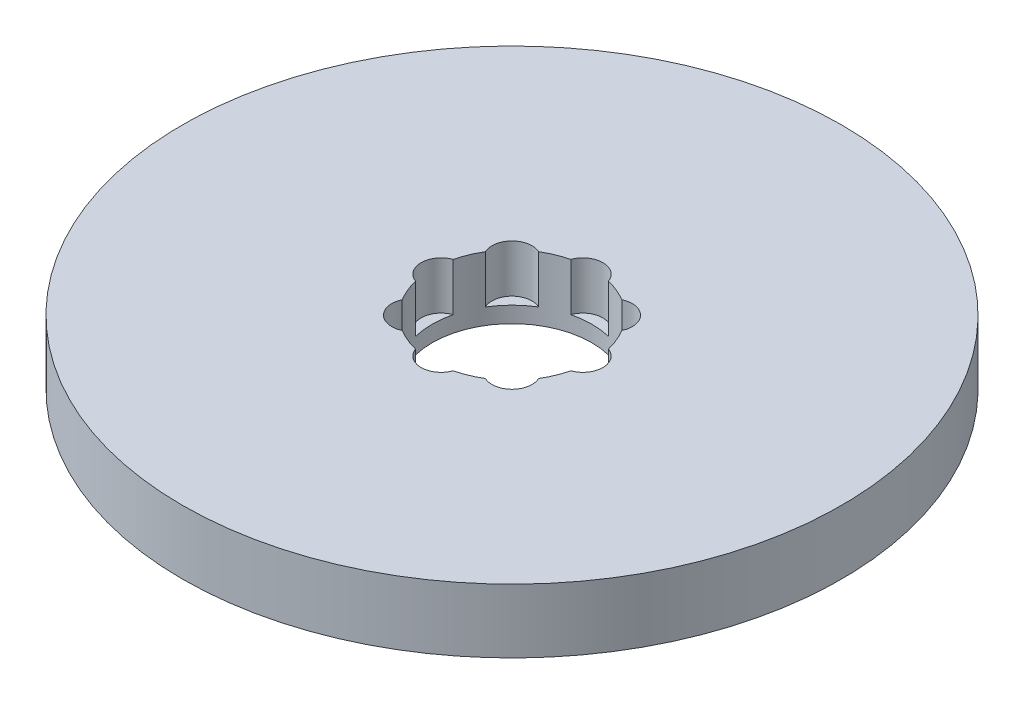
ISO-10303-21;
HEADER;
FILE_DESCRIPTION(('STEP AP214'),'2;1');
FILE_NAME('part.step','',(''),(''),'','','');
FILE_SCHEMA(('AUTOMOTIVE_DESIGN { 1 0 10303 214 1 1 1 1 }'));
ENDSEC;
DATA;
#1=APPLICATION_CONTEXT('core data for automotive mechanical design processes');
#2=APPLICATION_PROTOCOL_DEFINITION('international standard','automotive_design',2000,#1);
#3=PRODUCT_CONTEXT('',#1,'mechanical');
#4=PRODUCT('Part','Part','',(#3));
#5=PRODUCT_RELATED_PRODUCT_CATEGORY('part','',(#4));
#6=PRODUCT_DEFINITION_FORMATION('','',#4);
#7=PRODUCT_DEFINITION_CONTEXT('part definition',#1,'design');
#8=PRODUCT_DEFINITION('design','',#6,#7);
#9=PRODUCT_DEFINITION_SHAPE('','',#8);
#10=(LENGTH_UNIT() NAMED_UNIT(*) SI_UNIT(.MILLI.,.METRE.));
#11=(NAMED_UNIT(*) PLANE_ANGLE_UNIT() SI_UNIT($,.RADIAN.));
#12=(NAMED_UNIT(*) SI_UNIT($,.STERADIAN.) SOLID_ANGLE_UNIT());
#13=UNCERTAINTY_MEASURE_WITH_UNIT(LENGTH_MEASURE(1.E-05),#10,'distance_accuracy_value','');
#14=(GEOMETRIC_REPRESENTATION_CONTEXT(3) GLOBAL_UNCERTAINTY_ASSIGNED_CONTEXT((#13)) GLOBAL_UNIT_ASSIGNED_CONTEXT((#10,
#11,#12)) REPRESENTATION_CONTEXT('',''));
#15=CARTESIAN_POINT('',(0.,0.,0.));
#16=DIRECTION('',(0.,0.,1.));
#17=DIRECTION('',(1.,0.,0.));
#18=AXIS2_PLACEMENT_3D('',#15,#16,#17);
#19=CARTESIAN_POINT('',(0.,16.,0.));
#20=DIRECTION('',(0.,-1.,0.));
#21=DIRECTION('',(0.,0.,-1.));
#22=AXIS2_PLACEMENT_3D('',#19,#20,#21);
#23=CYLINDRICAL_SURFACE('',#22,82.5);
#24=CARTESIAN_POINT('',(0.,16.,0.));
#25=DIRECTION('',(0.,1.,0.));
#26=DIRECTION('',(0.,0.,1.));
#27=AXIS2_PLACEMENT_3D('',#24,#25,#26);
#28=CIRCLE('',#27,82.5);
#29=CARTESIAN_POINT('',(0.,16.,82.5));
#30=VERTEX_POINT('',#29);
#31=EDGE_CURVE('E183',#30,#30,#28,.T.);
#32=ORIENTED_EDGE('',*,*,#31,.F.);
#33=EDGE_LOOP('',(#32));
#34=FACE_BOUND('',#33,.T.);
#35=CARTESIAN_POINT('',(0.,0.,0.));
#36=DIRECTION('',(0.,1.,0.));
#37=DIRECTION('',(0.,0.,1.));
#38=AXIS2_PLACEMENT_3D('',#35,#36,#37);
#39=CIRCLE('',#38,82.5);
#40=CARTESIAN_POINT('',(0.,0.,82.5));
#41=VERTEX_POINT('',#40);
#42=EDGE_CURVE('E182',#41,#41,#39,.T.);
#43=ORIENTED_EDGE('',*,*,#42,.T.);
#44=EDGE_LOOP('',(#43));
#45=FACE_BOUND('',#44,.T.);
#46=ADVANCED_FACE('F39',(#34,#45),#23,.T.);
#47=CARTESIAN_POINT('',(0.,16.,0.));
#48=DIRECTION('',(0.,1.,0.));
#49=DIRECTION('',(0.,0.,1.));
#50=AXIS2_PLACEMENT_3D('',#47,#48,#49);
#51=PLANE('',#50);
#52=CARTESIAN_POINT('',(0.,16.,17.7423799245553));
#53=DIRECTION('',(0.,1.,0.));
#54=DIRECTION('',(1.,0.,0.));
#55=AXIS2_PLACEMENT_3D('',#52,#53,#54);
#56=CIRCLE('',#55,5.0091004251743);
#57=CARTESIAN_POINT('',(-4.71390584492632,16.,19.4365401161104));
#58=VERTEX_POINT('',#57);
#59=CARTESIAN_POINT('',(4.71390584492646,16.,19.4365401161104));
#60=VERTEX_POINT('',#59);
#61=EDGE_CURVE('E256',#58,#60,#56,.T.);
#62=ORIENTED_EDGE('',*,*,#61,.F.);
#63=CARTESIAN_POINT('',(0.,16.,0.));
#64=DIRECTION('',(0.,1.,0.));
#65=DIRECTION('',(0.,0.,1.));
#66=AXIS2_PLACEMENT_3D('',#63,#64,#65);
#67=CIRCLE('',#66,20.);
#68=CARTESIAN_POINT('',(-10.4104745300836,16.,17.0769441077284));
#69=VERTEX_POINT('',#68);
#70=EDGE_CURVE('E175',#69,#58,#67,.T.);
#71=ORIENTED_EDGE('',*,*,#70,.F.);
#72=CARTESIAN_POINT('',(-12.5457571590411,16.,12.5457571590411));
#73=DIRECTION('',(0.,1.,0.));
#74=DIRECTION('',(0.707106781186549,0.,0.707106781186546));
#75=AXIS2_PLACEMENT_3D('',#72,#73,#74);
#76=CIRCLE('',#75,5.0091004251743);
#77=CARTESIAN_POINT('',(-17.0769441077284,16.,10.4104745300837));
#78=VERTEX_POINT('',#77);
#79=EDGE_CURVE('E152',#78,#69,#76,.T.);
#80=ORIENTED_EDGE('',*,*,#79,.F.);
#81=CARTESIAN_POINT('',(-19.4365401161104,16.,4.71390584492639));
#82=VERTEX_POINT('',#81);
#83=EDGE_CURVE('E168',#82,#78,#67,.T.);
#84=ORIENTED_EDGE('',*,*,#83,.F.);
#85=CARTESIAN_POINT('',(-17.7423799245553,16.,0.));
#86=DIRECTION('',(0.,1.,0.));
#87=DIRECTION('',(0.,0.,1.));
#88=AXIS2_PLACEMENT_3D('',#85,#86,#87);
#89=CIRCLE('',#88,5.0091004251743);
#90=CARTESIAN_POINT('',(-19.4365401161104,16.,-4.71390584492639));
#91=VERTEX_POINT('',#90);
#92=EDGE_CURVE('E205',#91,#82,#89,.T.);
#93=ORIENTED_EDGE('',*,*,#92,.F.);
#94=CARTESIAN_POINT('',(-17.0769441077285,16.,-10.4104745300835));
#95=VERTEX_POINT('',#94);
#96=EDGE_CURVE('E181',#95,#91,#67,.T.);
#97=ORIENTED_EDGE('',*,*,#96,.F.);
#98=CARTESIAN_POINT('',(-12.5457571590412,16.,-12.5457571590409));
#99=DIRECTION('',(0.,1.,0.));
#100=DIRECTION('',(-0.707106781186539,0.,0.707106781186556));
#101=AXIS2_PLACEMENT_3D('',#98,#99,#100);
#102=CIRCLE('',#101,5.0091004251743);
#103=CARTESIAN_POINT('',(-10.4104745300839,16.,-17.0769441077283));
#104=VERTEX_POINT('',#103);
#105=EDGE_CURVE('E453',#104,#95,#102,.T.);
#106=ORIENTED_EDGE('',*,*,#105,.F.);
#107=CARTESIAN_POINT('',(-4.71390584492659,16.,-19.4365401161104));
#108=VERTEX_POINT('',#107);
#109=EDGE_CURVE('E189',#108,#104,#67,.T.);
#110=ORIENTED_EDGE('',*,*,#109,.F.);
#111=CARTESIAN_POINT('',(-1.85841565239749E-13,16.,-17.7423799245553));
#112=DIRECTION('',(0.,1.,0.));
#113=DIRECTION('',(-1.,0.,0.));
#114=AXIS2_PLACEMENT_3D('',#111,#112,#113);
#115=CIRCLE('',#114,5.0091004251743);
#116=CARTESIAN_POINT('',(4.71390584492619,16.,-19.4365401161105));
#117=VERTEX_POINT('',#116);
#118=EDGE_CURVE('E462',#117,#108,#115,.T.);
#119=ORIENTED_EDGE('',*,*,#118,.F.);
#120=CARTESIAN_POINT('',(10.4104745300835,16.,-17.0769441077285));
#121=VERTEX_POINT('',#120);
#122=EDGE_CURVE('E197',#121,#117,#67,.T.);
#123=ORIENTED_EDGE('',*,*,#122,.F.);
#124=CARTESIAN_POINT('',(12.545757159041,16.,-12.5457571590412));
#125=DIRECTION('',(0.,1.,0.));
#126=DIRECTION('',(-0.707106781186554,0.,-0.707106781186541));
#127=AXIS2_PLACEMENT_3D('',#124,#125,#126);
#128=CIRCLE('',#127,5.0091004251743);
#129=CARTESIAN_POINT('',(17.0769441077283,16.,-10.4104745300838));
#130=VERTEX_POINT('',#129);
#131=EDGE_CURVE('E470',#130,#121,#128,.T.);
#132=ORIENTED_EDGE('',*,*,#131,.F.);
#133=CARTESIAN_POINT('',(19.4365401161104,16.,-4.71390584492639));
#134=VERTEX_POINT('',#133);
#135=EDGE_CURVE('E489',#134,#130,#67,.T.);
#136=ORIENTED_EDGE('',*,*,#135,.F.);
#137=CARTESIAN_POINT('',(17.7423799245553,16.,0.));
#138=DIRECTION('',(0.,1.,0.));
#139=DIRECTION('',(0.,0.,-1.));
#140=AXIS2_PLACEMENT_3D('',#137,#138,#139);
#141=CIRCLE('',#140,5.0091004251743);
#142=CARTESIAN_POINT('',(19.4365401161104,16.,4.71390584492639));
#143=VERTEX_POINT('',#142);
#144=EDGE_CURVE('E476',#143,#134,#141,.T.);
#145=ORIENTED_EDGE('',*,*,#144,.F.);
#146=CARTESIAN_POINT('',(17.0769441077284,16.,10.4104745300836));
#147=VERTEX_POINT('',#146);
#148=EDGE_CURVE('E491',#147,#143,#67,.T.);
#149=ORIENTED_EDGE('',*,*,#148,.F.);
#150=CARTESIAN_POINT('',(12.5457571590412,16.,12.545757159041));
#151=DIRECTION('',(0.,1.,0.));
#152=DIRECTION('',(0.707106781186544,0.,-0.707106781186551));
#153=AXIS2_PLACEMENT_3D('',#150,#151,#152);
#154=CIRCLE('',#153,5.0091004251743);
#155=CARTESIAN_POINT('',(10.4104745300838,16.,17.0769441077283));
#156=VERTEX_POINT('',#155);
#157=EDGE_CURVE('E475',#156,#147,#154,.T.);
#158=ORIENTED_EDGE('',*,*,#157,.F.);
#159=EDGE_CURVE('E190',#60,#156,#67,.T.);
#160=ORIENTED_EDGE('',*,*,#159,.F.);
#161=EDGE_LOOP('',(#62,#71,#80,#84,#93,#97,#106,#110,#119,#123,#132,#136,#145,#149,#158,#160));
#162=FACE_BOUND('',#161,.T.);
#163=ORIENTED_EDGE('',*,*,#31,.T.);
#164=EDGE_LOOP('',(#163));
#165=FACE_BOUND('',#164,.T.);
#166=ADVANCED_FACE('F170',(#162,#165),#51,.T.);
#167=CARTESIAN_POINT('',(0.,0.,0.));
#168=DIRECTION('',(0.,1.,0.));
#169=DIRECTION('',(0.,0.,1.));
#170=AXIS2_PLACEMENT_3D('',#167,#168,#169);
#171=PLANE('',#170);
#172=CARTESIAN_POINT('',(0.,0.,0.));
#173=DIRECTION('',(0.,1.,0.));
#174=DIRECTION('',(0.,0.,1.));
#175=AXIS2_PLACEMENT_3D('',#172,#173,#174);
#176=CIRCLE('',#175,20.);
#177=CARTESIAN_POINT('',(0.,0.,20.));
#178=VERTEX_POINT('',#177);
#179=EDGE_CURVE('E191',#178,#178,#176,.T.);
#180=ORIENTED_EDGE('',*,*,#179,.T.);
#181=EDGE_LOOP('',(#180));
#182=FACE_BOUND('',#181,.T.);
#183=ORIENTED_EDGE('',*,*,#42,.F.);
#184=EDGE_LOOP('',(#183));
#185=FACE_BOUND('',#184,.T.);
#186=ADVANCED_FACE('F277',(#182,#185),#171,.F.);
#187=CARTESIAN_POINT('',(0.,16.,0.));
#188=DIRECTION('',(0.,-1.,0.));
#189=DIRECTION('',(0.,0.,-1.));
#190=AXIS2_PLACEMENT_3D('',#187,#188,#189);
#191=CYLINDRICAL_SURFACE('',#190,20.);
#192=DIRECTION('',(0.,1.,0.));
#193=VECTOR('',#192,1.);
#194=CARTESIAN_POINT('',(-4.71390584492632,10.0114633136479,19.4365401161104));
#195=LINE('',#194,#193);
#196=CARTESIAN_POINT('',(-4.71390584492632,4.02292662729571,19.4365401161104));
#197=VERTEX_POINT('',#196);
#198=EDGE_CURVE('E11',#197,#58,#195,.T.);
#199=ORIENTED_EDGE('',*,*,#198,.F.);
#200=CARTESIAN_POINT('',(0.,4.02292662729571,0.));
#201=DIRECTION('',(0.,1.,0.));
#202=DIRECTION('',(0.,0.,1.));
#203=AXIS2_PLACEMENT_3D('',#200,#201,#202);
#204=CIRCLE('',#203,20.);
#205=CARTESIAN_POINT('',(4.71390584492646,4.02292662729571,19.4365401161104));
#206=VERTEX_POINT('',#205);
#207=EDGE_CURVE('E251',#197,#206,#204,.T.);
#208=ORIENTED_EDGE('',*,*,#207,.T.);
#209=DIRECTION('',(0.,1.,0.));
#210=VECTOR('',#209,1.);
#211=CARTESIAN_POINT('',(4.71390584492646,10.0114633136479,19.4365401161104));
#212=LINE('',#211,#210);
#213=EDGE_CURVE('E46',#60,#206,#212,.F.);
#214=ORIENTED_EDGE('',*,*,#213,.F.);
#215=ORIENTED_EDGE('',*,*,#159,.T.);
#216=DIRECTION('',(0.,1.,0.));
#217=VECTOR('',#216,1.);
#218=CARTESIAN_POINT('',(10.4104745300838,10.0114633136479,17.0769441077283));
#219=LINE('',#218,#217);
#220=CARTESIAN_POINT('',(10.4104745300838,4.02292662729571,17.0769441077283));
#221=VERTEX_POINT('',#220);
#222=EDGE_CURVE('E253',#221,#156,#219,.T.);
#223=ORIENTED_EDGE('',*,*,#222,.F.);
#224=CARTESIAN_POINT('',(0.,4.02292662729571,0.));
#225=DIRECTION('',(0.,1.,0.));
#226=DIRECTION('',(0.,0.,1.));
#227=AXIS2_PLACEMENT_3D('',#224,#225,#226);
#228=CIRCLE('',#227,20.);
#229=CARTESIAN_POINT('',(17.0769441077284,4.02292662729571,10.4104745300836));
#230=VERTEX_POINT('',#229);
#231=EDGE_CURVE('E246',#221,#230,#228,.T.);
#232=ORIENTED_EDGE('',*,*,#231,.T.);
#233=DIRECTION('',(0.,1.,0.));
#234=VECTOR('',#233,1.);
#235=CARTESIAN_POINT('',(17.0769441077284,10.0114633136479,10.4104745300836));
#236=LINE('',#235,#234);
#237=EDGE_CURVE('E248',#147,#230,#236,.F.);
#238=ORIENTED_EDGE('',*,*,#237,.F.);
#239=ORIENTED_EDGE('',*,*,#148,.T.);
#240=DIRECTION('',(0.,1.,0.));
#241=VECTOR('',#240,1.);
#242=CARTESIAN_POINT('',(19.4365401161104,10.0114633136479,4.71390584492639));
#243=LINE('',#242,#241);
#244=CARTESIAN_POINT('',(19.4365401161104,4.02292662729571,4.71390584492639));
#245=VERTEX_POINT('',#244);
#246=EDGE_CURVE('E243',#245,#143,#243,.T.);
#247=ORIENTED_EDGE('',*,*,#246,.F.);
#248=CARTESIAN_POINT('',(0.,4.02292662729571,0.));
#249=DIRECTION('',(0.,1.,0.));
#250=DIRECTION('',(0.,0.,1.));
#251=AXIS2_PLACEMENT_3D('',#248,#249,#250);
#252=CIRCLE('',#251,20.);
#253=CARTESIAN_POINT('',(19.4365401161104,4.02292662729571,-4.71390584492639));
#254=VERTEX_POINT('',#253);
#255=EDGE_CURVE('E236',#245,#254,#252,.T.);
#256=ORIENTED_EDGE('',*,*,#255,.T.);
#257=DIRECTION('',(0.,1.,0.));
#258=VECTOR('',#257,1.);
#259=CARTESIAN_POINT('',(19.4365401161104,10.0114633136479,-4.71390584492639));
#260=LINE('',#259,#258);
#261=EDGE_CURVE('E241',#134,#254,#260,.F.);
#262=ORIENTED_EDGE('',*,*,#261,.F.);
#263=ORIENTED_EDGE('',*,*,#135,.T.);
#264=DIRECTION('',(0.,1.,0.));
#265=VECTOR('',#264,1.);
#266=CARTESIAN_POINT('',(17.0769441077283,10.0114633136479,-10.4104745300838));
#267=LINE('',#266,#265);
#268=CARTESIAN_POINT('',(17.0769441077283,4.02292662729571,-10.4104745300838));
#269=VERTEX_POINT('',#268);
#270=EDGE_CURVE('E237',#269,#130,#267,.T.);
#271=ORIENTED_EDGE('',*,*,#270,.F.);
#272=CARTESIAN_POINT('',(0.,4.02292662729571,0.));
#273=DIRECTION('',(0.,1.,0.));
#274=DIRECTION('',(0.,0.,1.));
#275=AXIS2_PLACEMENT_3D('',#272,#273,#274);
#276=CIRCLE('',#275,20.);
#277=CARTESIAN_POINT('',(10.4104745300835,4.02292662729571,-17.0769441077285));
#278=VERTEX_POINT('',#277);
#279=EDGE_CURVE('E229',#269,#278,#276,.T.);
#280=ORIENTED_EDGE('',*,*,#279,.T.);
#281=DIRECTION('',(0.,1.,0.));
#282=VECTOR('',#281,1.);
#283=CARTESIAN_POINT('',(10.4104745300835,10.0114633136479,-17.0769441077285));
#284=LINE('',#283,#282);
#285=EDGE_CURVE('E232',#121,#278,#284,.F.);
#286=ORIENTED_EDGE('',*,*,#285,.F.);
#287=ORIENTED_EDGE('',*,*,#122,.T.);
#288=DIRECTION('',(0.,1.,0.));
#289=VECTOR('',#288,1.);
#290=CARTESIAN_POINT('',(4.71390584492619,10.0114633136479,-19.4365401161105));
#291=LINE('',#290,#289);
#292=CARTESIAN_POINT('',(4.71390584492619,4.02292662729571,-19.4365401161105));
#293=VERTEX_POINT('',#292);
#294=EDGE_CURVE('E227',#293,#117,#291,.T.);
#295=ORIENTED_EDGE('',*,*,#294,.F.);
#296=CARTESIAN_POINT('',(0.,4.02292662729571,0.));
#297=DIRECTION('',(0.,1.,0.));
#298=DIRECTION('',(0.,0.,1.));
#299=AXIS2_PLACEMENT_3D('',#296,#297,#298);
#300=CIRCLE('',#299,20.);
#301=CARTESIAN_POINT('',(-4.71390584492659,4.02292662729571,-19.4365401161104));
#302=VERTEX_POINT('',#301);
#303=EDGE_CURVE('E225',#293,#302,#300,.T.);
#304=ORIENTED_EDGE('',*,*,#303,.T.);
#305=DIRECTION('',(0.,1.,0.));
#306=VECTOR('',#305,1.);
#307=CARTESIAN_POINT('',(-4.71390584492659,10.0114633136479,-19.4365401161104));
#308=LINE('',#307,#306);
#309=EDGE_CURVE('E223',#108,#302,#308,.F.);
#310=ORIENTED_EDGE('',*,*,#309,.F.);
#311=ORIENTED_EDGE('',*,*,#109,.T.);
#312=DIRECTION('',(0.,1.,0.));
#313=VECTOR('',#312,1.);
#314=CARTESIAN_POINT('',(-10.4104745300839,10.0114633136479,-17.0769441077283));
#315=LINE('',#314,#313);
#316=CARTESIAN_POINT('',(-10.4104745300839,4.02292662729571,-17.0769441077283));
#317=VERTEX_POINT('',#316);
#318=EDGE_CURVE('E219',#317,#104,#315,.T.);
#319=ORIENTED_EDGE('',*,*,#318,.F.);
#320=CARTESIAN_POINT('',(0.,4.02292662729571,0.));
#321=DIRECTION('',(0.,1.,0.));
#322=DIRECTION('',(0.,0.,1.));
#323=AXIS2_PLACEMENT_3D('',#320,#321,#322);
#324=CIRCLE('',#323,20.);
#325=CARTESIAN_POINT('',(-17.0769441077285,4.02292662729571,-10.4104745300835));
#326=VERTEX_POINT('',#325);
#327=EDGE_CURVE('E159',#317,#326,#324,.T.);
#328=ORIENTED_EDGE('',*,*,#327,.T.);
#329=DIRECTION('',(0.,1.,0.));
#330=VECTOR('',#329,1.);
#331=CARTESIAN_POINT('',(-17.0769441077285,10.0114633136479,-10.4104745300835));
#332=LINE('',#331,#330);
#333=EDGE_CURVE('E220',#95,#326,#332,.F.);
#334=ORIENTED_EDGE('',*,*,#333,.F.);
#335=ORIENTED_EDGE('',*,*,#96,.T.);
#336=DIRECTION('',(0.,1.,0.));
#337=VECTOR('',#336,1.);
#338=CARTESIAN_POINT('',(-19.4365401161104,10.0114633136479,-4.71390584492639));
#339=LINE('',#338,#337);
#340=CARTESIAN_POINT('',(-19.4365401161104,4.02292662729571,-4.71390584492639));
#341=VERTEX_POINT('',#340);
#342=EDGE_CURVE('E209',#341,#91,#339,.T.);
#343=ORIENTED_EDGE('',*,*,#342,.F.);
#344=CARTESIAN_POINT('',(0.,4.02292662729571,0.));
#345=DIRECTION('',(0.,1.,0.));
#346=DIRECTION('',(0.,0.,1.));
#347=AXIS2_PLACEMENT_3D('',#344,#345,#346);
#348=CIRCLE('',#347,20.);
#349=CARTESIAN_POINT('',(-19.4365401161104,4.02292662729571,4.71390584492639));
#350=VERTEX_POINT('',#349);
#351=EDGE_CURVE('E206',#341,#350,#348,.T.);
#352=ORIENTED_EDGE('',*,*,#351,.T.);
#353=DIRECTION('',(0.,1.,0.));
#354=VECTOR('',#353,1.);
#355=CARTESIAN_POINT('',(-19.4365401161104,10.0114633136479,4.71390584492639));
#356=LINE('',#355,#354);
#357=EDGE_CURVE('E179',#82,#350,#356,.F.);
#358=ORIENTED_EDGE('',*,*,#357,.F.);
#359=ORIENTED_EDGE('',*,*,#83,.T.);
#360=DIRECTION('',(0.,1.,0.));
#361=VECTOR('',#360,1.);
#362=CARTESIAN_POINT('',(-17.0769441077284,10.0114633136479,10.4104745300837));
#363=LINE('',#362,#361);
#364=CARTESIAN_POINT('',(-17.0769441077284,4.02292662729571,10.4104745300837));
#365=VERTEX_POINT('',#364);
#366=EDGE_CURVE('E147',#365,#78,#363,.T.);
#367=ORIENTED_EDGE('',*,*,#366,.F.);
#368=CARTESIAN_POINT('',(0.,4.02292662729571,0.));
#369=DIRECTION('',(0.,1.,0.));
#370=DIRECTION('',(0.,0.,1.));
#371=AXIS2_PLACEMENT_3D('',#368,#369,#370);
#372=CIRCLE('',#371,20.);
#373=CARTESIAN_POINT('',(-10.4104745300836,4.02292662729571,17.0769441077284));
#374=VERTEX_POINT('',#373);
#375=EDGE_CURVE('E215',#365,#374,#372,.T.);
#376=ORIENTED_EDGE('',*,*,#375,.T.);
#377=DIRECTION('',(0.,1.,0.));
#378=VECTOR('',#377,1.);
#379=CARTESIAN_POINT('',(-10.4104745300837,10.0114633136479,17.0769441077284));
#380=LINE('',#379,#378);
#381=EDGE_CURVE('E161',#69,#374,#380,.F.);
#382=ORIENTED_EDGE('',*,*,#381,.F.);
#383=ORIENTED_EDGE('',*,*,#70,.T.);
#384=EDGE_LOOP('',(#199,#208,#214,#215,#223,#232,#238,#239,#247,#256,#262,#263,#271,#280,#286,
#287,#295,#304,#310,#311,#319,#328,#334,#335,#343,#352,#358,#359,#367,#376,#382,#383));
#385=FACE_BOUND('',#384,.T.);
#386=ORIENTED_EDGE('',*,*,#179,.F.);
#387=EDGE_LOOP('',(#386));
#388=FACE_BOUND('',#387,.T.);
#389=ADVANCED_FACE('F176',(#385,#388),#191,.F.);
#390=CARTESIAN_POINT('',(-17.7423799245553,4.02292662729571,0.));
#391=DIRECTION('',(0.,1.,0.));
#392=DIRECTION('',(0.,0.,1.));
#393=AXIS2_PLACEMENT_3D('',#390,#391,#392);
#394=CYLINDRICAL_SURFACE('',#393,5.0091004251743);
#395=ORIENTED_EDGE('',*,*,#342,.T.);
#396=ORIENTED_EDGE('',*,*,#92,.T.);
#397=ORIENTED_EDGE('',*,*,#357,.T.);
#398=CARTESIAN_POINT('',(-17.7423799245553,4.02292662729571,0.));
#399=DIRECTION('',(0.,1.,0.));
#400=DIRECTION('',(0.,0.,1.));
#401=AXIS2_PLACEMENT_3D('',#398,#399,#400);
#402=CIRCLE('',#401,5.0091004251743);
#403=EDGE_CURVE('E200',#341,#350,#402,.T.);
#404=ORIENTED_EDGE('',*,*,#403,.F.);
#405=EDGE_LOOP('',(#395,#396,#397,#404));
#406=FACE_BOUND('',#405,.T.);
#407=ADVANCED_FACE('F286',(#406),#394,.F.);
#408=CARTESIAN_POINT('',(-17.7423799245553,4.02292662729571,0.));
#409=DIRECTION('',(0.,1.,0.));
#410=DIRECTION('',(0.,0.,1.));
#411=AXIS2_PLACEMENT_3D('',#408,#409,#410);
#412=PLANE('',#411);
#413=ORIENTED_EDGE('',*,*,#403,.T.);
#414=ORIENTED_EDGE('',*,*,#351,.F.);
#415=EDGE_LOOP('',(#413,#414));
#416=FACE_BOUND('',#415,.T.);
#417=ADVANCED_FACE('F289',(#416),#412,.T.);
#418=CARTESIAN_POINT('',(-12.5457571590411,4.02292662729571,12.5457571590411));
#419=DIRECTION('',(0.,1.,0.));
#420=DIRECTION('',(0.,0.,1.));
#421=AXIS2_PLACEMENT_3D('',#418,#419,#420);
#422=CYLINDRICAL_SURFACE('',#421,5.0091004251743);
#423=ORIENTED_EDGE('',*,*,#366,.T.);
#424=ORIENTED_EDGE('',*,*,#79,.T.);
#425=ORIENTED_EDGE('',*,*,#381,.T.);
#426=CARTESIAN_POINT('',(-12.5457571590411,4.02292662729571,12.5457571590411));
#427=DIRECTION('',(0.,1.,0.));
#428=DIRECTION('',(0.707106781186549,0.,0.707106781186546));
#429=AXIS2_PLACEMENT_3D('',#426,#427,#428);
#430=CIRCLE('',#429,5.0091004251743);
#431=EDGE_CURVE('E156',#365,#374,#430,.T.);
#432=ORIENTED_EDGE('',*,*,#431,.F.);
#433=EDGE_LOOP('',(#423,#424,#425,#432));
#434=FACE_BOUND('',#433,.T.);
#435=ADVANCED_FACE('F155',(#434),#422,.F.);
#436=CARTESIAN_POINT('',(-12.5457571590411,4.02292662729571,12.5457571590411));
#437=DIRECTION('',(0.,1.,0.));
#438=DIRECTION('',(0.707106781186549,0.,0.707106781186546));
#439=AXIS2_PLACEMENT_3D('',#436,#437,#438);
#440=PLANE('',#439);
#441=ORIENTED_EDGE('',*,*,#431,.T.);
#442=ORIENTED_EDGE('',*,*,#375,.F.);
#443=EDGE_LOOP('',(#441,#442));
#444=FACE_BOUND('',#443,.T.);
#445=ADVANCED_FACE('F300',(#444),#440,.T.);
#446=CARTESIAN_POINT('',(-12.5457571590412,4.02292662729571,-12.5457571590409));
#447=DIRECTION('',(0.,1.,0.));
#448=DIRECTION('',(0.,0.,1.));
#449=AXIS2_PLACEMENT_3D('',#446,#447,#448);
#450=CYLINDRICAL_SURFACE('',#449,5.0091004251743);
#451=ORIENTED_EDGE('',*,*,#318,.T.);
#452=ORIENTED_EDGE('',*,*,#105,.T.);
#453=ORIENTED_EDGE('',*,*,#333,.T.);
#454=CARTESIAN_POINT('',(-12.5457571590412,4.02292662729571,-12.5457571590409));
#455=DIRECTION('',(0.,1.,0.));
#456=DIRECTION('',(-0.707106781186539,0.,0.707106781186556));
#457=AXIS2_PLACEMENT_3D('',#454,#455,#456);
#458=CIRCLE('',#457,5.0091004251743);
#459=EDGE_CURVE('E454',#317,#326,#458,.T.);
#460=ORIENTED_EDGE('',*,*,#459,.F.);
#461=EDGE_LOOP('',(#451,#452,#453,#460));
#462=FACE_BOUND('',#461,.T.);
#463=ADVANCED_FACE('F299',(#462),#450,.F.);
#464=CARTESIAN_POINT('',(-12.5457571590412,4.02292662729571,-12.5457571590409));
#465=DIRECTION('',(0.,1.,0.));
#466=DIRECTION('',(-0.707106781186539,0.,0.707106781186556));
#467=AXIS2_PLACEMENT_3D('',#464,#465,#466);
#468=PLANE('',#467);
#469=ORIENTED_EDGE('',*,*,#459,.T.);
#470=ORIENTED_EDGE('',*,*,#327,.F.);
#471=EDGE_LOOP('',(#469,#470));
#472=FACE_BOUND('',#471,.T.);
#473=ADVANCED_FACE('F379',(#472),#468,.T.);
#474=CARTESIAN_POINT('',(-1.85841565239749E-13,4.02292662729571,-17.7423799245553));
#475=DIRECTION('',(0.,1.,0.));
#476=DIRECTION('',(0.,0.,1.));
#477=AXIS2_PLACEMENT_3D('',#474,#475,#476);
#478=CYLINDRICAL_SURFACE('',#477,5.0091004251743);
#479=ORIENTED_EDGE('',*,*,#294,.T.);
#480=ORIENTED_EDGE('',*,*,#118,.T.);
#481=ORIENTED_EDGE('',*,*,#309,.T.);
#482=CARTESIAN_POINT('',(-1.85841565239749E-13,4.02292662729571,-17.7423799245553));
#483=DIRECTION('',(0.,1.,0.));
#484=DIRECTION('',(-1.,0.,0.));
#485=AXIS2_PLACEMENT_3D('',#482,#483,#484);
#486=CIRCLE('',#485,5.0091004251743);
#487=EDGE_CURVE('E465',#293,#302,#486,.T.);
#488=ORIENTED_EDGE('',*,*,#487,.F.);
#489=EDGE_LOOP('',(#479,#480,#481,#488));
#490=FACE_BOUND('',#489,.T.);
#491=ADVANCED_FACE('F371',(#490),#478,.F.);
#492=CARTESIAN_POINT('',(-1.85841565239749E-13,4.02292662729571,-17.7423799245553));
#493=DIRECTION('',(0.,1.,0.));
#494=DIRECTION('',(-1.,0.,0.));
#495=AXIS2_PLACEMENT_3D('',#492,#493,#494);
#496=PLANE('',#495);
#497=ORIENTED_EDGE('',*,*,#487,.T.);
#498=ORIENTED_EDGE('',*,*,#303,.F.);
#499=EDGE_LOOP('',(#497,#498));
#500=FACE_BOUND('',#499,.T.);
#501=ADVANCED_FACE('F308',(#500),#496,.T.);
#502=CARTESIAN_POINT('',(12.545757159041,4.02292662729571,-12.5457571590412));
#503=DIRECTION('',(0.,1.,0.));
#504=DIRECTION('',(0.,0.,1.));
#505=AXIS2_PLACEMENT_3D('',#502,#503,#504);
#506=CYLINDRICAL_SURFACE('',#505,5.0091004251743);
#507=ORIENTED_EDGE('',*,*,#270,.T.);
#508=ORIENTED_EDGE('',*,*,#131,.T.);
#509=ORIENTED_EDGE('',*,*,#285,.T.);
#510=CARTESIAN_POINT('',(12.545757159041,4.02292662729571,-12.5457571590412));
#511=DIRECTION('',(0.,1.,0.));
#512=DIRECTION('',(-0.707106781186554,0.,-0.707106781186541));
#513=AXIS2_PLACEMENT_3D('',#510,#511,#512);
#514=CIRCLE('',#513,5.0091004251743);
#515=EDGE_CURVE('E477',#269,#278,#514,.T.);
#516=ORIENTED_EDGE('',*,*,#515,.F.);
#517=EDGE_LOOP('',(#507,#508,#509,#516));
#518=FACE_BOUND('',#517,.T.);
#519=ADVANCED_FACE('F305',(#518),#506,.F.);
#520=CARTESIAN_POINT('',(12.545757159041,4.02292662729571,-12.5457571590412));
#521=DIRECTION('',(0.,1.,0.));
#522=DIRECTION('',(-0.707106781186554,0.,-0.707106781186541));
#523=AXIS2_PLACEMENT_3D('',#520,#521,#522);
#524=PLANE('',#523);
#525=ORIENTED_EDGE('',*,*,#515,.T.);
#526=ORIENTED_EDGE('',*,*,#279,.F.);
#527=EDGE_LOOP('',(#525,#526));
#528=FACE_BOUND('',#527,.T.);
#529=ADVANCED_FACE('F304',(#528),#524,.T.);
#530=CARTESIAN_POINT('',(17.7423799245553,4.02292662729571,0.));
#531=DIRECTION('',(0.,1.,0.));
#532=DIRECTION('',(0.,0.,1.));
#533=AXIS2_PLACEMENT_3D('',#530,#531,#532);
#534=CYLINDRICAL_SURFACE('',#533,5.0091004251743);
#535=ORIENTED_EDGE('',*,*,#246,.T.);
#536=ORIENTED_EDGE('',*,*,#144,.T.);
#537=ORIENTED_EDGE('',*,*,#261,.T.);
#538=CARTESIAN_POINT('',(17.7423799245553,4.02292662729571,0.));
#539=DIRECTION('',(0.,1.,0.));
#540=DIRECTION('',(0.,0.,-1.));
#541=AXIS2_PLACEMENT_3D('',#538,#539,#540);
#542=CIRCLE('',#541,5.0091004251743);
#543=EDGE_CURVE('E478',#245,#254,#542,.T.);
#544=ORIENTED_EDGE('',*,*,#543,.F.);
#545=EDGE_LOOP('',(#535,#536,#537,#544));
#546=FACE_BOUND('',#545,.T.);
#547=ADVANCED_FACE('F309',(#546),#534,.F.);
#548=CARTESIAN_POINT('',(17.7423799245553,4.02292662729571,0.));
#549=DIRECTION('',(0.,1.,0.));
#550=DIRECTION('',(0.,0.,-1.));
#551=AXIS2_PLACEMENT_3D('',#548,#549,#550);
#552=PLANE('',#551);
#553=ORIENTED_EDGE('',*,*,#543,.T.);
#554=ORIENTED_EDGE('',*,*,#255,.F.);
#555=EDGE_LOOP('',(#553,#554));
#556=FACE_BOUND('',#555,.T.);
#557=ADVANCED_FACE('F314',(#556),#552,.T.);
#558=CARTESIAN_POINT('',(12.5457571590412,4.02292662729571,12.545757159041));
#559=DIRECTION('',(0.,1.,0.));
#560=DIRECTION('',(0.,0.,1.));
#561=AXIS2_PLACEMENT_3D('',#558,#559,#560);
#562=CYLINDRICAL_SURFACE('',#561,5.0091004251743);
#563=ORIENTED_EDGE('',*,*,#222,.T.);
#564=ORIENTED_EDGE('',*,*,#157,.T.);
#565=ORIENTED_EDGE('',*,*,#237,.T.);
#566=CARTESIAN_POINT('',(12.5457571590412,4.02292662729571,12.545757159041));
#567=DIRECTION('',(0.,1.,0.));
#568=DIRECTION('',(0.707106781186544,0.,-0.707106781186551));
#569=AXIS2_PLACEMENT_3D('',#566,#567,#568);
#570=CIRCLE('',#569,5.0091004251743);
#571=EDGE_CURVE('E56',#221,#230,#570,.T.);
#572=ORIENTED_EDGE('',*,*,#571,.F.);
#573=EDGE_LOOP('',(#563,#564,#565,#572));
#574=FACE_BOUND('',#573,.T.);
#575=ADVANCED_FACE('F318',(#574),#562,.F.);
#576=CARTESIAN_POINT('',(12.5457571590412,4.02292662729571,12.545757159041));
#577=DIRECTION('',(0.,1.,0.));
#578=DIRECTION('',(0.707106781186544,0.,-0.707106781186551));
#579=AXIS2_PLACEMENT_3D('',#576,#577,#578);
#580=PLANE('',#579);
#581=ORIENTED_EDGE('',*,*,#571,.T.);
#582=ORIENTED_EDGE('',*,*,#231,.F.);
#583=EDGE_LOOP('',(#581,#582));
#584=FACE_BOUND('',#583,.T.);
#585=ADVANCED_FACE('F270',(#584),#580,.T.);
#586=CARTESIAN_POINT('',(0.,4.02292662729571,17.7423799245553));
#587=DIRECTION('',(0.,1.,0.));
#588=DIRECTION('',(0.,0.,1.));
#589=AXIS2_PLACEMENT_3D('',#586,#587,#588);
#590=CYLINDRICAL_SURFACE('',#589,5.0091004251743);
#591=ORIENTED_EDGE('',*,*,#198,.T.);
#592=ORIENTED_EDGE('',*,*,#61,.T.);
#593=ORIENTED_EDGE('',*,*,#213,.T.);
#594=CARTESIAN_POINT('',(0.,4.02292662729571,17.7423799245553));
#595=DIRECTION('',(0.,1.,0.));
#596=DIRECTION('',(1.,0.,0.));
#597=AXIS2_PLACEMENT_3D('',#594,#595,#596);
#598=CIRCLE('',#597,5.0091004251743);
#599=EDGE_CURVE('E55',#197,#206,#598,.T.);
#600=ORIENTED_EDGE('',*,*,#599,.F.);
#601=EDGE_LOOP('',(#591,#592,#593,#600));
#602=FACE_BOUND('',#601,.T.);
#603=ADVANCED_FACE('F260',(#602),#590,.F.);
#604=CARTESIAN_POINT('',(0.,4.02292662729571,17.7423799245553));
#605=DIRECTION('',(0.,1.,0.));
#606=DIRECTION('',(1.,0.,0.));
#607=AXIS2_PLACEMENT_3D('',#604,#605,#606);
#608=PLANE('',#607);
#609=ORIENTED_EDGE('',*,*,#599,.T.);
#610=ORIENTED_EDGE('',*,*,#207,.F.);
#611=EDGE_LOOP('',(#609,#610));
#612=FACE_BOUND('',#611,.T.);
#613=ADVANCED_FACE('F261',(#612),#608,.T.);
#614=CLOSED_SHELL('',(#46,#166,#186,#389,#407,#417,#435,#445,#463,#473,#491,#501,#519,#529,#547,
#557,#575,#585,#603,#613));
#615=MANIFOLD_SOLID_BREP('B2',#614);
#616=ADVANCED_BREP_SHAPE_REPRESENTATION('',(#18,#615),#14);
#617=SHAPE_DEFINITION_REPRESENTATION(#9,#616);
ENDSEC;
END-ISO-10303-21;
